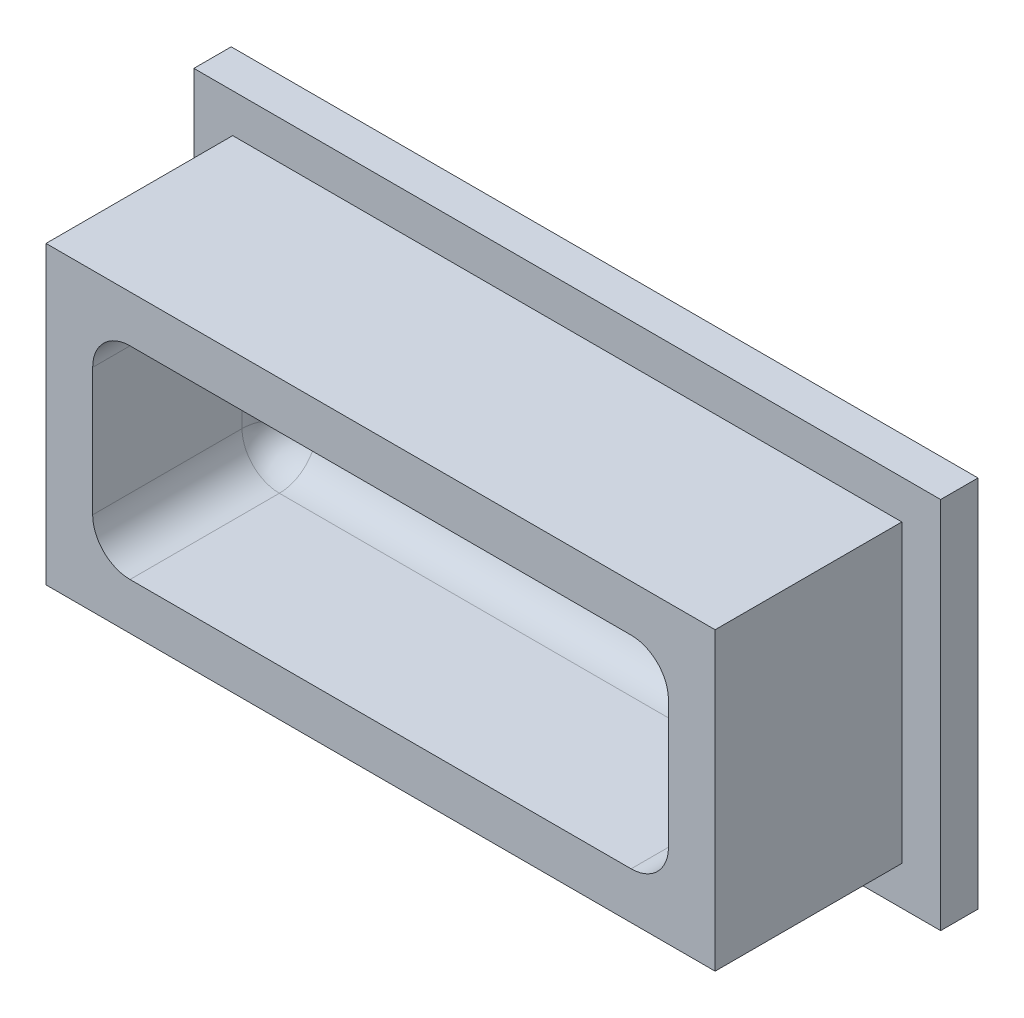
ISO-10303-21;
HEADER;
FILE_DESCRIPTION(('STEP AP214'),'2;1');
FILE_NAME('part.step','',(''),(''),'','','');
FILE_SCHEMA(('AUTOMOTIVE_DESIGN { 1 0 10303 214 1 1 1 1 }'));
ENDSEC;
DATA;
#1=APPLICATION_CONTEXT('core data for automotive mechanical design processes');
#2=APPLICATION_PROTOCOL_DEFINITION('international standard','automotive_design',2000,#1);
#3=PRODUCT_CONTEXT('',#1,'mechanical');
#4=PRODUCT('Part','Part','',(#3));
#5=PRODUCT_RELATED_PRODUCT_CATEGORY('part','',(#4));
#6=PRODUCT_DEFINITION_FORMATION('','',#4);
#7=PRODUCT_DEFINITION_CONTEXT('part definition',#1,'design');
#8=PRODUCT_DEFINITION('design','',#6,#7);
#9=PRODUCT_DEFINITION_SHAPE('','',#8);
#10=(LENGTH_UNIT() NAMED_UNIT(*) SI_UNIT(.MILLI.,.METRE.));
#11=(NAMED_UNIT(*) PLANE_ANGLE_UNIT() SI_UNIT($,.RADIAN.));
#12=(NAMED_UNIT(*) SI_UNIT($,.STERADIAN.) SOLID_ANGLE_UNIT());
#13=UNCERTAINTY_MEASURE_WITH_UNIT(LENGTH_MEASURE(1.E-05),#10,'distance_accuracy_value','');
#14=(GEOMETRIC_REPRESENTATION_CONTEXT(3) GLOBAL_UNCERTAINTY_ASSIGNED_CONTEXT((#13)) GLOBAL_UNIT_ASSIGNED_CONTEXT((#10,
#11,#12)) REPRESENTATION_CONTEXT('',''));
#15=CARTESIAN_POINT('',(0.,0.,0.));
#16=DIRECTION('',(0.,0.,1.));
#17=DIRECTION('',(1.,0.,0.));
#18=AXIS2_PLACEMENT_3D('',#15,#16,#17);
#19=CARTESIAN_POINT('',(0.,0.,2.));
#20=DIRECTION('',(0.,0.,-1.));
#21=DIRECTION('',(-1.,0.,0.));
#22=AXIS2_PLACEMENT_3D('',#19,#20,#21);
#23=PLANE('',#22);
#24=DIRECTION('',(0.,1.,0.));
#25=VECTOR('',#24,1.);
#26=CARTESIAN_POINT('',(20.,-10.,2.));
#27=LINE('',#26,#25);
#28=CARTESIAN_POINT('',(20.,-10.,2.));
#29=VERTEX_POINT('',#28);
#30=CARTESIAN_POINT('',(20.,10.,2.));
#31=VERTEX_POINT('',#30);
#32=EDGE_CURVE('E193',#29,#31,#27,.T.);
#33=ORIENTED_EDGE('',*,*,#32,.T.);
#34=DIRECTION('',(-1.,0.,0.));
#35=VECTOR('',#34,1.);
#36=CARTESIAN_POINT('',(-20.,10.,2.));
#37=LINE('',#36,#35);
#38=CARTESIAN_POINT('',(-20.,10.,2.));
#39=VERTEX_POINT('',#38);
#40=EDGE_CURVE('E196',#31,#39,#37,.T.);
#41=ORIENTED_EDGE('',*,*,#40,.T.);
#42=DIRECTION('',(0.,-1.,0.));
#43=VECTOR('',#42,1.);
#44=CARTESIAN_POINT('',(-20.,-10.,2.));
#45=LINE('',#44,#43);
#46=CARTESIAN_POINT('',(-20.,-10.,2.));
#47=VERTEX_POINT('',#46);
#48=EDGE_CURVE('E199',#39,#47,#45,.T.);
#49=ORIENTED_EDGE('',*,*,#48,.T.);
#50=DIRECTION('',(1.,0.,0.));
#51=VECTOR('',#50,1.);
#52=CARTESIAN_POINT('',(-20.,-10.,2.));
#53=LINE('',#52,#51);
#54=EDGE_CURVE('E201',#47,#29,#53,.T.);
#55=ORIENTED_EDGE('',*,*,#54,.T.);
#56=EDGE_LOOP('',(#33,#41,#49,#55));
#57=FACE_BOUND('',#56,.T.);
#58=DIRECTION('',(0.,-1.,0.));
#59=VECTOR('',#58,1.);
#60=CARTESIAN_POINT('',(-17.92,7.92,2.));
#61=LINE('',#60,#59);
#62=CARTESIAN_POINT('',(-17.92,7.92,2.));
#63=VERTEX_POINT('',#62);
#64=CARTESIAN_POINT('',(-17.92,-7.92,2.));
#65=VERTEX_POINT('',#64);
#66=EDGE_CURVE('E183',#63,#65,#61,.T.);
#67=ORIENTED_EDGE('',*,*,#66,.F.);
#68=DIRECTION('',(-1.,0.,0.));
#69=VECTOR('',#68,1.);
#70=CARTESIAN_POINT('',(17.92,7.92,2.));
#71=LINE('',#70,#69);
#72=CARTESIAN_POINT('',(17.92,7.92,2.));
#73=VERTEX_POINT('',#72);
#74=EDGE_CURVE('E180',#73,#63,#71,.T.);
#75=ORIENTED_EDGE('',*,*,#74,.F.);
#76=DIRECTION('',(0.,1.,0.));
#77=VECTOR('',#76,1.);
#78=CARTESIAN_POINT('',(17.92,-7.92,2.));
#79=LINE('',#78,#77);
#80=CARTESIAN_POINT('',(17.92,-7.92,2.));
#81=VERTEX_POINT('',#80);
#82=EDGE_CURVE('E310',#81,#73,#79,.T.);
#83=ORIENTED_EDGE('',*,*,#82,.F.);
#84=DIRECTION('',(1.,0.,0.));
#85=VECTOR('',#84,1.);
#86=CARTESIAN_POINT('',(-17.92,-7.92,2.));
#87=LINE('',#86,#85);
#88=EDGE_CURVE('E307',#65,#81,#87,.T.);
#89=ORIENTED_EDGE('',*,*,#88,.F.);
#90=EDGE_LOOP('',(#67,#75,#83,#89));
#91=FACE_BOUND('',#90,.T.);
#92=ADVANCED_FACE('F33',(#57,#91),#23,.F.);
#93=CARTESIAN_POINT('',(20.,-10.,2.));
#94=DIRECTION('',(-1.,0.,0.));
#95=DIRECTION('',(0.,0.,1.));
#96=AXIS2_PLACEMENT_3D('',#93,#94,#95);
#97=PLANE('',#96);
#98=DIRECTION('',(0.,1.,0.));
#99=VECTOR('',#98,1.);
#100=CARTESIAN_POINT('',(20.,-10.,0.));
#101=LINE('',#100,#99);
#102=CARTESIAN_POINT('',(20.,-10.,0.));
#103=VERTEX_POINT('',#102);
#104=CARTESIAN_POINT('',(20.,10.,0.));
#105=VERTEX_POINT('',#104);
#106=EDGE_CURVE('E184',#103,#105,#101,.T.);
#107=ORIENTED_EDGE('',*,*,#106,.T.);
#108=DIRECTION('',(0.,0.,-1.));
#109=VECTOR('',#108,1.);
#110=CARTESIAN_POINT('',(20.,10.,2.));
#111=LINE('',#110,#109);
#112=EDGE_CURVE('E216',#31,#105,#111,.T.);
#113=ORIENTED_EDGE('',*,*,#112,.F.);
#114=ORIENTED_EDGE('',*,*,#32,.F.);
#115=DIRECTION('',(0.,0.,-1.));
#116=VECTOR('',#115,1.);
#117=CARTESIAN_POINT('',(20.,-10.,2.));
#118=LINE('',#117,#116);
#119=EDGE_CURVE('E202',#29,#103,#118,.T.);
#120=ORIENTED_EDGE('',*,*,#119,.T.);
#121=EDGE_LOOP('',(#107,#113,#114,#120));
#122=FACE_BOUND('',#121,.T.);
#123=ADVANCED_FACE('F323',(#122),#97,.F.);
#124=CARTESIAN_POINT('',(-20.,10.,2.));
#125=DIRECTION('',(0.,-1.,0.));
#126=DIRECTION('',(0.,0.,-1.));
#127=AXIS2_PLACEMENT_3D('',#124,#125,#126);
#128=PLANE('',#127);
#129=DIRECTION('',(-1.,0.,0.));
#130=VECTOR('',#129,1.);
#131=CARTESIAN_POINT('',(-20.,10.,0.));
#132=LINE('',#131,#130);
#133=CARTESIAN_POINT('',(-20.,10.,0.));
#134=VERTEX_POINT('',#133);
#135=EDGE_CURVE('E187',#105,#134,#132,.T.);
#136=ORIENTED_EDGE('',*,*,#135,.T.);
#137=DIRECTION('',(0.,0.,-1.));
#138=VECTOR('',#137,1.);
#139=CARTESIAN_POINT('',(-20.,10.,2.));
#140=LINE('',#139,#138);
#141=EDGE_CURVE('E213',#39,#134,#140,.T.);
#142=ORIENTED_EDGE('',*,*,#141,.F.);
#143=ORIENTED_EDGE('',*,*,#40,.F.);
#144=ORIENTED_EDGE('',*,*,#112,.T.);
#145=EDGE_LOOP('',(#136,#142,#143,#144));
#146=FACE_BOUND('',#145,.T.);
#147=ADVANCED_FACE('F329',(#146),#128,.F.);
#148=CARTESIAN_POINT('',(-20.,-10.,2.));
#149=DIRECTION('',(1.,0.,0.));
#150=DIRECTION('',(0.,0.,-1.));
#151=AXIS2_PLACEMENT_3D('',#148,#149,#150);
#152=PLANE('',#151);
#153=DIRECTION('',(0.,-1.,0.));
#154=VECTOR('',#153,1.);
#155=CARTESIAN_POINT('',(-20.,-10.,0.));
#156=LINE('',#155,#154);
#157=CARTESIAN_POINT('',(-20.,-10.,0.));
#158=VERTEX_POINT('',#157);
#159=EDGE_CURVE('E205',#134,#158,#156,.T.);
#160=ORIENTED_EDGE('',*,*,#159,.T.);
#161=DIRECTION('',(0.,0.,-1.));
#162=VECTOR('',#161,1.);
#163=CARTESIAN_POINT('',(-20.,-10.,2.));
#164=LINE('',#163,#162);
#165=EDGE_CURVE('E210',#47,#158,#164,.T.);
#166=ORIENTED_EDGE('',*,*,#165,.F.);
#167=ORIENTED_EDGE('',*,*,#48,.F.);
#168=ORIENTED_EDGE('',*,*,#141,.T.);
#169=EDGE_LOOP('',(#160,#166,#167,#168));
#170=FACE_BOUND('',#169,.T.);
#171=ADVANCED_FACE('F342',(#170),#152,.F.);
#172=CARTESIAN_POINT('',(-20.,-10.,2.));
#173=DIRECTION('',(0.,1.,0.));
#174=DIRECTION('',(0.,0.,1.));
#175=AXIS2_PLACEMENT_3D('',#172,#173,#174);
#176=PLANE('',#175);
#177=DIRECTION('',(1.,0.,0.));
#178=VECTOR('',#177,1.);
#179=CARTESIAN_POINT('',(-20.,-10.,0.));
#180=LINE('',#179,#178);
#181=EDGE_CURVE('E197',#158,#103,#180,.T.);
#182=ORIENTED_EDGE('',*,*,#181,.T.);
#183=ORIENTED_EDGE('',*,*,#119,.F.);
#184=ORIENTED_EDGE('',*,*,#54,.F.);
#185=ORIENTED_EDGE('',*,*,#165,.T.);
#186=EDGE_LOOP('',(#182,#183,#184,#185));
#187=FACE_BOUND('',#186,.T.);
#188=ADVANCED_FACE('F338',(#187),#176,.F.);
#189=CARTESIAN_POINT('',(0.,0.,0.));
#190=DIRECTION('',(0.,0.,-1.));
#191=DIRECTION('',(-1.,0.,0.));
#192=AXIS2_PLACEMENT_3D('',#189,#190,#191);
#193=PLANE('',#192);
#194=ORIENTED_EDGE('',*,*,#106,.F.);
#195=ORIENTED_EDGE('',*,*,#181,.F.);
#196=ORIENTED_EDGE('',*,*,#159,.F.);
#197=ORIENTED_EDGE('',*,*,#135,.F.);
#198=EDGE_LOOP('',(#194,#195,#196,#197));
#199=FACE_BOUND('',#198,.T.);
#200=ADVANCED_FACE('F335',(#199),#193,.T.);
#201=CARTESIAN_POINT('',(-17.92,7.92,12.));
#202=DIRECTION('',(1.,0.,0.));
#203=DIRECTION('',(0.,0.,-1.));
#204=AXIS2_PLACEMENT_3D('',#201,#202,#203);
#205=PLANE('',#204);
#206=ORIENTED_EDGE('',*,*,#66,.T.);
#207=DIRECTION('',(0.,0.,-1.));
#208=VECTOR('',#207,1.);
#209=CARTESIAN_POINT('',(-17.92,-7.92,12.));
#210=LINE('',#209,#208);
#211=CARTESIAN_POINT('',(-17.92,-7.92,12.));
#212=VERTEX_POINT('',#211);
#213=EDGE_CURVE('E164',#212,#65,#210,.T.);
#214=ORIENTED_EDGE('',*,*,#213,.F.);
#215=DIRECTION('',(0.,-1.,0.));
#216=VECTOR('',#215,1.);
#217=CARTESIAN_POINT('',(-17.92,7.92,12.));
#218=LINE('',#217,#216);
#219=CARTESIAN_POINT('',(-17.92,7.92,12.));
#220=VERTEX_POINT('',#219);
#221=EDGE_CURVE('E171',#220,#212,#218,.T.);
#222=ORIENTED_EDGE('',*,*,#221,.F.);
#223=DIRECTION('',(0.,0.,-1.));
#224=VECTOR('',#223,1.);
#225=CARTESIAN_POINT('',(-17.92,7.92,12.));
#226=LINE('',#225,#224);
#227=EDGE_CURVE('E305',#220,#63,#226,.T.);
#228=ORIENTED_EDGE('',*,*,#227,.T.);
#229=EDGE_LOOP('',(#206,#214,#222,#228));
#230=FACE_BOUND('',#229,.T.);
#231=ADVANCED_FACE('F182',(#230),#205,.F.);
#232=CARTESIAN_POINT('',(-17.92,-7.92,12.));
#233=DIRECTION('',(0.,1.,0.));
#234=DIRECTION('',(0.,0.,1.));
#235=AXIS2_PLACEMENT_3D('',#232,#233,#234);
#236=PLANE('',#235);
#237=ORIENTED_EDGE('',*,*,#88,.T.);
#238=DIRECTION('',(0.,0.,-1.));
#239=VECTOR('',#238,1.);
#240=CARTESIAN_POINT('',(17.92,-7.92,12.));
#241=LINE('',#240,#239);
#242=CARTESIAN_POINT('',(17.92,-7.92,12.));
#243=VERTEX_POINT('',#242);
#244=EDGE_CURVE('E167',#243,#81,#241,.T.);
#245=ORIENTED_EDGE('',*,*,#244,.F.);
#246=DIRECTION('',(1.,0.,0.));
#247=VECTOR('',#246,1.);
#248=CARTESIAN_POINT('',(-17.92,-7.92,12.));
#249=LINE('',#248,#247);
#250=EDGE_CURVE('E159',#212,#243,#249,.T.);
#251=ORIENTED_EDGE('',*,*,#250,.F.);
#252=ORIENTED_EDGE('',*,*,#213,.T.);
#253=EDGE_LOOP('',(#237,#245,#251,#252));
#254=FACE_BOUND('',#253,.T.);
#255=ADVANCED_FACE('F162',(#254),#236,.F.);
#256=CARTESIAN_POINT('',(17.92,-7.92,12.));
#257=DIRECTION('',(-1.,0.,0.));
#258=DIRECTION('',(0.,0.,1.));
#259=AXIS2_PLACEMENT_3D('',#256,#257,#258);
#260=PLANE('',#259);
#261=ORIENTED_EDGE('',*,*,#82,.T.);
#262=DIRECTION('',(0.,0.,-1.));
#263=VECTOR('',#262,1.);
#264=CARTESIAN_POINT('',(17.92,7.92,12.));
#265=LINE('',#264,#263);
#266=CARTESIAN_POINT('',(17.92,7.92,12.));
#267=VERTEX_POINT('',#266);
#268=EDGE_CURVE('E189',#267,#73,#265,.T.);
#269=ORIENTED_EDGE('',*,*,#268,.F.);
#270=DIRECTION('',(0.,1.,0.));
#271=VECTOR('',#270,1.);
#272=CARTESIAN_POINT('',(17.92,-7.92,12.));
#273=LINE('',#272,#271);
#274=EDGE_CURVE('E170',#243,#267,#273,.T.);
#275=ORIENTED_EDGE('',*,*,#274,.F.);
#276=ORIENTED_EDGE('',*,*,#244,.T.);
#277=EDGE_LOOP('',(#261,#269,#275,#276));
#278=FACE_BOUND('',#277,.T.);
#279=ADVANCED_FACE('F320',(#278),#260,.F.);
#280=CARTESIAN_POINT('',(17.92,7.92,12.));
#281=DIRECTION('',(0.,-1.,0.));
#282=DIRECTION('',(0.,0.,-1.));
#283=AXIS2_PLACEMENT_3D('',#280,#281,#282);
#284=PLANE('',#283);
#285=ORIENTED_EDGE('',*,*,#74,.T.);
#286=ORIENTED_EDGE('',*,*,#227,.F.);
#287=DIRECTION('',(-1.,0.,0.));
#288=VECTOR('',#287,1.);
#289=CARTESIAN_POINT('',(17.92,7.92,12.));
#290=LINE('',#289,#288);
#291=EDGE_CURVE('E176',#267,#220,#290,.T.);
#292=ORIENTED_EDGE('',*,*,#291,.F.);
#293=ORIENTED_EDGE('',*,*,#268,.T.);
#294=EDGE_LOOP('',(#285,#286,#292,#293));
#295=FACE_BOUND('',#294,.T.);
#296=ADVANCED_FACE('F318',(#295),#284,.F.);
#297=CARTESIAN_POINT('',(0.,0.,12.));
#298=DIRECTION('',(0.,0.,1.));
#299=DIRECTION('',(1.,0.,0.));
#300=AXIS2_PLACEMENT_3D('',#297,#298,#299);
#301=PLANE('',#300);
#302=DIRECTION('',(0.,-1.,0.));
#303=VECTOR('',#302,1.);
#304=CARTESIAN_POINT('',(-15.42,5.42,12.));
#305=LINE('',#304,#303);
#306=CARTESIAN_POINT('',(-15.42,3.42,12.));
#307=VERTEX_POINT('',#306);
#308=CARTESIAN_POINT('',(-15.42,-3.42,12.));
#309=VERTEX_POINT('',#308);
#310=EDGE_CURVE('E293',#307,#309,#305,.T.);
#311=ORIENTED_EDGE('',*,*,#310,.F.);
#312=CARTESIAN_POINT('',(-13.42,3.42,12.));
#313=DIRECTION('',(0.,0.,1.));
#314=DIRECTION('',(1.,0.,0.));
#315=AXIS2_PLACEMENT_3D('',#312,#313,#314);
#316=CIRCLE('',#315,2.);
#317=CARTESIAN_POINT('',(-13.42,5.42,12.));
#318=VERTEX_POINT('',#317);
#319=EDGE_CURVE('E11',#307,#318,#316,.F.);
#320=ORIENTED_EDGE('',*,*,#319,.T.);
#321=DIRECTION('',(-1.,0.,0.));
#322=VECTOR('',#321,1.);
#323=CARTESIAN_POINT('',(15.42,5.42,12.));
#324=LINE('',#323,#322);
#325=CARTESIAN_POINT('',(13.42,5.42,12.));
#326=VERTEX_POINT('',#325);
#327=EDGE_CURVE('E288',#326,#318,#324,.T.);
#328=ORIENTED_EDGE('',*,*,#327,.F.);
#329=CARTESIAN_POINT('',(13.42,3.42,12.));
#330=DIRECTION('',(0.,0.,1.));
#331=DIRECTION('',(1.,0.,0.));
#332=AXIS2_PLACEMENT_3D('',#329,#330,#331);
#333=CIRCLE('',#332,2.);
#334=CARTESIAN_POINT('',(15.42,3.42,12.));
#335=VERTEX_POINT('',#334);
#336=EDGE_CURVE('E250',#326,#335,#333,.F.);
#337=ORIENTED_EDGE('',*,*,#336,.T.);
#338=DIRECTION('',(0.,1.,0.));
#339=VECTOR('',#338,1.);
#340=CARTESIAN_POINT('',(15.42,-5.42,12.));
#341=LINE('',#340,#339);
#342=CARTESIAN_POINT('',(15.42,-3.42,12.));
#343=VERTEX_POINT('',#342);
#344=EDGE_CURVE('E308',#343,#335,#341,.T.);
#345=ORIENTED_EDGE('',*,*,#344,.F.);
#346=CARTESIAN_POINT('',(13.42,-3.42,12.));
#347=DIRECTION('',(0.,0.,1.));
#348=DIRECTION('',(1.,0.,0.));
#349=AXIS2_PLACEMENT_3D('',#346,#347,#348);
#350=CIRCLE('',#349,2.);
#351=CARTESIAN_POINT('',(13.42,-5.42,12.));
#352=VERTEX_POINT('',#351);
#353=EDGE_CURVE('E252',#343,#352,#350,.F.);
#354=ORIENTED_EDGE('',*,*,#353,.T.);
#355=DIRECTION('',(1.,0.,0.));
#356=VECTOR('',#355,1.);
#357=CARTESIAN_POINT('',(-15.42,-5.42,12.));
#358=LINE('',#357,#356);
#359=CARTESIAN_POINT('',(-13.42,-5.42,12.));
#360=VERTEX_POINT('',#359);
#361=EDGE_CURVE('E299',#360,#352,#358,.T.);
#362=ORIENTED_EDGE('',*,*,#361,.F.);
#363=CARTESIAN_POINT('',(-13.42,-3.42,12.));
#364=DIRECTION('',(0.,0.,1.));
#365=DIRECTION('',(1.,0.,0.));
#366=AXIS2_PLACEMENT_3D('',#363,#364,#365);
#367=CIRCLE('',#366,2.);
#368=EDGE_CURVE('E42',#360,#309,#367,.F.);
#369=ORIENTED_EDGE('',*,*,#368,.T.);
#370=EDGE_LOOP('',(#311,#320,#328,#337,#345,#354,#362,#369));
#371=FACE_BOUND('',#370,.T.);
#372=ORIENTED_EDGE('',*,*,#221,.T.);
#373=ORIENTED_EDGE('',*,*,#250,.T.);
#374=ORIENTED_EDGE('',*,*,#274,.T.);
#375=ORIENTED_EDGE('',*,*,#291,.T.);
#376=EDGE_LOOP('',(#372,#373,#374,#375));
#377=FACE_BOUND('',#376,.T.);
#378=ADVANCED_FACE('F174',(#371,#377),#301,.T.);
#379=CARTESIAN_POINT('',(0.,0.,2.));
#380=DIRECTION('',(0.,0.,-1.));
#381=DIRECTION('',(-1.,0.,0.));
#382=AXIS2_PLACEMENT_3D('',#379,#380,#381);
#383=PLANE('',#382);
#384=DIRECTION('',(1.,0.,0.));
#385=VECTOR('',#384,1.);
#386=CARTESIAN_POINT('',(15.42,-3.42,2.));
#387=LINE('',#386,#385);
#388=CARTESIAN_POINT('',(-13.42,-3.42,2.));
#389=VERTEX_POINT('',#388);
#390=CARTESIAN_POINT('',(13.42,-3.42,2.));
#391=VERTEX_POINT('',#390);
#392=EDGE_CURVE('E50',#389,#391,#387,.T.);
#393=ORIENTED_EDGE('',*,*,#392,.T.);
#394=DIRECTION('',(0.,1.,0.));
#395=VECTOR('',#394,1.);
#396=CARTESIAN_POINT('',(13.42,5.42,2.));
#397=LINE('',#396,#395);
#398=CARTESIAN_POINT('',(13.42,3.42,2.));
#399=VERTEX_POINT('',#398);
#400=EDGE_CURVE('E248',#391,#399,#397,.T.);
#401=ORIENTED_EDGE('',*,*,#400,.T.);
#402=DIRECTION('',(-1.,0.,0.));
#403=VECTOR('',#402,1.);
#404=CARTESIAN_POINT('',(-15.42,3.42,2.));
#405=LINE('',#404,#403);
#406=CARTESIAN_POINT('',(-13.42,3.42,2.));
#407=VERTEX_POINT('',#406);
#408=EDGE_CURVE('E244',#399,#407,#405,.T.);
#409=ORIENTED_EDGE('',*,*,#408,.T.);
#410=DIRECTION('',(0.,-1.,0.));
#411=VECTOR('',#410,1.);
#412=CARTESIAN_POINT('',(-13.42,-5.42,2.));
#413=LINE('',#412,#411);
#414=EDGE_CURVE('E55',#407,#389,#413,.T.);
#415=ORIENTED_EDGE('',*,*,#414,.T.);
#416=EDGE_LOOP('',(#393,#401,#409,#415));
#417=FACE_BOUND('',#416,.T.);
#418=ADVANCED_FACE('F429',(#417),#383,.F.);
#419=CARTESIAN_POINT('',(-15.42,5.42,-30.6896191473685));
#420=DIRECTION('',(-1.,0.,0.));
#421=DIRECTION('',(0.,0.,1.));
#422=AXIS2_PLACEMENT_3D('',#419,#420,#421);
#423=PLANE('',#422);
#424=ORIENTED_EDGE('',*,*,#310,.T.);
#425=DIRECTION('',(0.,0.,1.));
#426=VECTOR('',#425,1.);
#427=CARTESIAN_POINT('',(-15.42,-3.42,2.));
#428=LINE('',#427,#426);
#429=CARTESIAN_POINT('',(-15.42,-3.42,4.));
#430=VERTEX_POINT('',#429);
#431=EDGE_CURVE('E242',#309,#430,#428,.F.);
#432=ORIENTED_EDGE('',*,*,#431,.T.);
#433=DIRECTION('',(0.,-1.,0.));
#434=VECTOR('',#433,1.);
#435=CARTESIAN_POINT('',(-15.42,5.42,4.));
#436=LINE('',#435,#434);
#437=CARTESIAN_POINT('',(-15.42,3.42,4.));
#438=VERTEX_POINT('',#437);
#439=EDGE_CURVE('E238',#430,#438,#436,.F.);
#440=ORIENTED_EDGE('',*,*,#439,.T.);
#441=DIRECTION('',(0.,0.,1.));
#442=VECTOR('',#441,1.);
#443=CARTESIAN_POINT('',(-15.42,3.42,12.));
#444=LINE('',#443,#442);
#445=EDGE_CURVE('E240',#438,#307,#444,.T.);
#446=ORIENTED_EDGE('',*,*,#445,.T.);
#447=EDGE_LOOP('',(#424,#432,#440,#446));
#448=FACE_BOUND('',#447,.T.);
#449=ADVANCED_FACE('F399',(#448),#423,.F.);
#450=CARTESIAN_POINT('',(-15.42,-5.42,-30.6896191473685));
#451=DIRECTION('',(0.,-1.,0.));
#452=DIRECTION('',(0.,0.,-1.));
#453=AXIS2_PLACEMENT_3D('',#450,#451,#452);
#454=PLANE('',#453);
#455=ORIENTED_EDGE('',*,*,#361,.T.);
#456=DIRECTION('',(0.,0.,1.));
#457=VECTOR('',#456,1.);
#458=CARTESIAN_POINT('',(13.42,-5.42,2.));
#459=LINE('',#458,#457);
#460=CARTESIAN_POINT('',(13.42,-5.42,4.));
#461=VERTEX_POINT('',#460);
#462=EDGE_CURVE('E236',#352,#461,#459,.F.);
#463=ORIENTED_EDGE('',*,*,#462,.T.);
#464=DIRECTION('',(1.,0.,0.));
#465=VECTOR('',#464,1.);
#466=CARTESIAN_POINT('',(-15.42,-5.42,4.));
#467=LINE('',#466,#465);
#468=CARTESIAN_POINT('',(-13.42,-5.42,4.));
#469=VERTEX_POINT('',#468);
#470=EDGE_CURVE('E232',#461,#469,#467,.F.);
#471=ORIENTED_EDGE('',*,*,#470,.T.);
#472=DIRECTION('',(0.,0.,1.));
#473=VECTOR('',#472,1.);
#474=CARTESIAN_POINT('',(-13.42,-5.42,12.));
#475=LINE('',#474,#473);
#476=EDGE_CURVE('E234',#469,#360,#475,.T.);
#477=ORIENTED_EDGE('',*,*,#476,.T.);
#478=EDGE_LOOP('',(#455,#463,#471,#477));
#479=FACE_BOUND('',#478,.T.);
#480=ADVANCED_FACE('F411',(#479),#454,.F.);
#481=CARTESIAN_POINT('',(15.42,-5.42,-30.6896191473685));
#482=DIRECTION('',(1.,0.,0.));
#483=DIRECTION('',(0.,0.,-1.));
#484=AXIS2_PLACEMENT_3D('',#481,#482,#483);
#485=PLANE('',#484);
#486=ORIENTED_EDGE('',*,*,#344,.T.);
#487=DIRECTION('',(0.,0.,1.));
#488=VECTOR('',#487,1.);
#489=CARTESIAN_POINT('',(15.42,3.42,2.));
#490=LINE('',#489,#488);
#491=CARTESIAN_POINT('',(15.42,3.42,4.));
#492=VERTEX_POINT('',#491);
#493=EDGE_CURVE('E230',#335,#492,#490,.F.);
#494=ORIENTED_EDGE('',*,*,#493,.T.);
#495=DIRECTION('',(0.,1.,0.));
#496=VECTOR('',#495,1.);
#497=CARTESIAN_POINT('',(15.42,-5.42,4.));
#498=LINE('',#497,#496);
#499=CARTESIAN_POINT('',(15.42,-3.42,4.));
#500=VERTEX_POINT('',#499);
#501=EDGE_CURVE('E226',#492,#500,#498,.F.);
#502=ORIENTED_EDGE('',*,*,#501,.T.);
#503=DIRECTION('',(0.,0.,1.));
#504=VECTOR('',#503,1.);
#505=CARTESIAN_POINT('',(15.42,-3.42,12.));
#506=LINE('',#505,#504);
#507=EDGE_CURVE('E228',#500,#343,#506,.T.);
#508=ORIENTED_EDGE('',*,*,#507,.T.);
#509=EDGE_LOOP('',(#486,#494,#502,#508));
#510=FACE_BOUND('',#509,.T.);
#511=ADVANCED_FACE('F419',(#510),#485,.F.);
#512=CARTESIAN_POINT('',(15.42,5.42,-30.6896191473685));
#513=DIRECTION('',(0.,1.,0.));
#514=DIRECTION('',(0.,0.,1.));
#515=AXIS2_PLACEMENT_3D('',#512,#513,#514);
#516=PLANE('',#515);
#517=DIRECTION('',(-1.,0.,0.));
#518=VECTOR('',#517,1.);
#519=CARTESIAN_POINT('',(15.42,5.42,4.));
#520=LINE('',#519,#518);
#521=CARTESIAN_POINT('',(-13.42,5.42,4.));
#522=VERTEX_POINT('',#521);
#523=CARTESIAN_POINT('',(13.42,5.42,4.));
#524=VERTEX_POINT('',#523);
#525=EDGE_CURVE('E219',#522,#524,#520,.F.);
#526=ORIENTED_EDGE('',*,*,#525,.T.);
#527=DIRECTION('',(0.,0.,1.));
#528=VECTOR('',#527,1.);
#529=CARTESIAN_POINT('',(13.42,5.42,12.));
#530=LINE('',#529,#528);
#531=EDGE_CURVE('E223',#524,#326,#530,.T.);
#532=ORIENTED_EDGE('',*,*,#531,.T.);
#533=ORIENTED_EDGE('',*,*,#327,.T.);
#534=DIRECTION('',(0.,0.,1.));
#535=VECTOR('',#534,1.);
#536=CARTESIAN_POINT('',(-13.42,5.42,2.));
#537=LINE('',#536,#535);
#538=EDGE_CURVE('E221',#318,#522,#537,.F.);
#539=ORIENTED_EDGE('',*,*,#538,.T.);
#540=EDGE_LOOP('',(#526,#532,#533,#539));
#541=FACE_BOUND('',#540,.T.);
#542=ADVANCED_FACE('F393',(#541),#516,.F.);
#543=CARTESIAN_POINT('',(-13.42,-3.42,-30.6896191473685));
#544=DIRECTION('',(0.,0.,-1.));
#545=DIRECTION('',(-1.,0.,0.));
#546=AXIS2_PLACEMENT_3D('',#543,#544,#545);
#547=CYLINDRICAL_SURFACE('',#546,2.);
#548=CARTESIAN_POINT('',(-13.42,-3.42,4.));
#549=DIRECTION('',(0.,0.,1.));
#550=DIRECTION('',(1.,0.,0.));
#551=AXIS2_PLACEMENT_3D('',#548,#549,#550);
#552=CIRCLE('',#551,2.);
#553=EDGE_CURVE('E37',#430,#469,#552,.T.);
#554=ORIENTED_EDGE('',*,*,#553,.F.);
#555=ORIENTED_EDGE('',*,*,#431,.F.);
#556=ORIENTED_EDGE('',*,*,#368,.F.);
#557=ORIENTED_EDGE('',*,*,#476,.F.);
#558=EDGE_LOOP('',(#554,#555,#556,#557));
#559=FACE_BOUND('',#558,.T.);
#560=ADVANCED_FACE('F35',(#559),#547,.F.);
#561=CARTESIAN_POINT('',(-13.42,-3.42,4.));
#562=DIRECTION('',(0.,0.,1.));
#563=DIRECTION('',(1.,0.,0.));
#564=AXIS2_PLACEMENT_3D('',#561,#562,#563);
#565=SPHERICAL_SURFACE('',#564,2.);
#566=CARTESIAN_POINT('',(-13.42,-3.42,4.));
#567=DIRECTION('',(0.,1.,0.));
#568=DIRECTION('',(0.,0.,1.));
#569=AXIS2_PLACEMENT_3D('',#566,#567,#568);
#570=CIRCLE('',#569,2.);
#571=EDGE_CURVE('E281',#430,#389,#570,.F.);
#572=ORIENTED_EDGE('',*,*,#571,.F.);
#573=ORIENTED_EDGE('',*,*,#553,.T.);
#574=CARTESIAN_POINT('',(-13.42,-3.42,4.));
#575=DIRECTION('',(1.,0.,0.));
#576=DIRECTION('',(0.,0.,-1.));
#577=AXIS2_PLACEMENT_3D('',#574,#575,#576);
#578=CIRCLE('',#577,2.);
#579=EDGE_CURVE('E282',#389,#469,#578,.F.);
#580=ORIENTED_EDGE('',*,*,#579,.F.);
#581=EDGE_LOOP('',(#572,#573,#580));
#582=FACE_BOUND('',#581,.T.);
#583=ADVANCED_FACE('F387',(#582),#565,.F.);
#584=CARTESIAN_POINT('',(13.42,-3.42,-30.6896191473685));
#585=DIRECTION('',(0.,0.,-1.));
#586=DIRECTION('',(-1.,0.,0.));
#587=AXIS2_PLACEMENT_3D('',#584,#585,#586);
#588=CYLINDRICAL_SURFACE('',#587,2.);
#589=ORIENTED_EDGE('',*,*,#353,.F.);
#590=ORIENTED_EDGE('',*,*,#507,.F.);
#591=CARTESIAN_POINT('',(13.42,-3.42,4.));
#592=DIRECTION('',(0.,0.,1.));
#593=DIRECTION('',(1.,0.,0.));
#594=AXIS2_PLACEMENT_3D('',#591,#592,#593);
#595=CIRCLE('',#594,2.);
#596=EDGE_CURVE('E278',#461,#500,#595,.T.);
#597=ORIENTED_EDGE('',*,*,#596,.F.);
#598=ORIENTED_EDGE('',*,*,#462,.F.);
#599=EDGE_LOOP('',(#589,#590,#597,#598));
#600=FACE_BOUND('',#599,.T.);
#601=ADVANCED_FACE('F385',(#600),#588,.F.);
#602=CARTESIAN_POINT('',(0.,-3.42,4.));
#603=DIRECTION('',(-1.,0.,0.));
#604=DIRECTION('',(0.,0.,1.));
#605=AXIS2_PLACEMENT_3D('',#602,#603,#604);
#606=CYLINDRICAL_SURFACE('',#605,2.);
#607=ORIENTED_EDGE('',*,*,#579,.T.);
#608=ORIENTED_EDGE('',*,*,#470,.F.);
#609=CARTESIAN_POINT('',(13.42,-3.42,4.));
#610=DIRECTION('',(-1.,0.,0.));
#611=DIRECTION('',(0.,0.,1.));
#612=AXIS2_PLACEMENT_3D('',#609,#610,#611);
#613=CIRCLE('',#612,2.);
#614=EDGE_CURVE('E275',#391,#461,#613,.T.);
#615=ORIENTED_EDGE('',*,*,#614,.F.);
#616=ORIENTED_EDGE('',*,*,#392,.F.);
#617=EDGE_LOOP('',(#607,#608,#615,#616));
#618=FACE_BOUND('',#617,.T.);
#619=ADVANCED_FACE('F381',(#618),#606,.F.);
#620=CARTESIAN_POINT('',(-13.42,0.,4.));
#621=DIRECTION('',(0.,1.,0.));
#622=DIRECTION('',(0.,0.,1.));
#623=AXIS2_PLACEMENT_3D('',#620,#621,#622);
#624=CYLINDRICAL_SURFACE('',#623,2.);
#625=ORIENTED_EDGE('',*,*,#571,.T.);
#626=ORIENTED_EDGE('',*,*,#414,.F.);
#627=CARTESIAN_POINT('',(-13.42,3.42,4.));
#628=DIRECTION('',(0.,-1.,0.));
#629=DIRECTION('',(0.,0.,-1.));
#630=AXIS2_PLACEMENT_3D('',#627,#628,#629);
#631=CIRCLE('',#630,2.);
#632=EDGE_CURVE('E272',#438,#407,#631,.T.);
#633=ORIENTED_EDGE('',*,*,#632,.F.);
#634=ORIENTED_EDGE('',*,*,#439,.F.);
#635=EDGE_LOOP('',(#625,#626,#633,#634));
#636=FACE_BOUND('',#635,.T.);
#637=ADVANCED_FACE('F377',(#636),#624,.F.);
#638=CARTESIAN_POINT('',(-13.42,3.42,-30.6896191473685));
#639=DIRECTION('',(0.,0.,-1.));
#640=DIRECTION('',(-1.,0.,0.));
#641=AXIS2_PLACEMENT_3D('',#638,#639,#640);
#642=CYLINDRICAL_SURFACE('',#641,2.);
#643=ORIENTED_EDGE('',*,*,#319,.F.);
#644=ORIENTED_EDGE('',*,*,#445,.F.);
#645=CARTESIAN_POINT('',(-13.42,3.42,4.));
#646=DIRECTION('',(0.,0.,1.));
#647=DIRECTION('',(1.,0.,0.));
#648=AXIS2_PLACEMENT_3D('',#645,#646,#647);
#649=CIRCLE('',#648,2.);
#650=EDGE_CURVE('E269',#522,#438,#649,.T.);
#651=ORIENTED_EDGE('',*,*,#650,.F.);
#652=ORIENTED_EDGE('',*,*,#538,.F.);
#653=EDGE_LOOP('',(#643,#644,#651,#652));
#654=FACE_BOUND('',#653,.T.);
#655=ADVANCED_FACE('F373',(#654),#642,.F.);
#656=CARTESIAN_POINT('',(13.42,-3.42,4.));
#657=DIRECTION('',(0.,0.,1.));
#658=DIRECTION('',(1.,0.,0.));
#659=AXIS2_PLACEMENT_3D('',#656,#657,#658);
#660=SPHERICAL_SURFACE('',#659,2.);
#661=ORIENTED_EDGE('',*,*,#614,.T.);
#662=ORIENTED_EDGE('',*,*,#596,.T.);
#663=CARTESIAN_POINT('',(13.42,-3.42,4.));
#664=DIRECTION('',(0.,1.,0.));
#665=DIRECTION('',(0.,0.,1.));
#666=AXIS2_PLACEMENT_3D('',#663,#664,#665);
#667=CIRCLE('',#666,2.);
#668=EDGE_CURVE('E266',#391,#500,#667,.F.);
#669=ORIENTED_EDGE('',*,*,#668,.F.);
#670=EDGE_LOOP('',(#661,#662,#669));
#671=FACE_BOUND('',#670,.T.);
#672=ADVANCED_FACE('F369',(#671),#660,.F.);
#673=CARTESIAN_POINT('',(-13.42,3.42,4.));
#674=DIRECTION('',(0.,0.,1.));
#675=DIRECTION('',(1.,0.,0.));
#676=AXIS2_PLACEMENT_3D('',#673,#674,#675);
#677=SPHERICAL_SURFACE('',#676,2.);
#678=ORIENTED_EDGE('',*,*,#650,.T.);
#679=ORIENTED_EDGE('',*,*,#632,.T.);
#680=CARTESIAN_POINT('',(-13.42,3.42,4.));
#681=DIRECTION('',(1.,0.,0.));
#682=DIRECTION('',(0.,0.,-1.));
#683=AXIS2_PLACEMENT_3D('',#680,#681,#682);
#684=CIRCLE('',#683,2.);
#685=EDGE_CURVE('E263',#522,#407,#684,.F.);
#686=ORIENTED_EDGE('',*,*,#685,.F.);
#687=EDGE_LOOP('',(#678,#679,#686));
#688=FACE_BOUND('',#687,.T.);
#689=ADVANCED_FACE('F365',(#688),#677,.F.);
#690=CARTESIAN_POINT('',(13.42,0.,4.));
#691=DIRECTION('',(0.,-1.,0.));
#692=DIRECTION('',(0.,0.,-1.));
#693=AXIS2_PLACEMENT_3D('',#690,#691,#692);
#694=CYLINDRICAL_SURFACE('',#693,2.);
#695=ORIENTED_EDGE('',*,*,#668,.T.);
#696=ORIENTED_EDGE('',*,*,#501,.F.);
#697=CARTESIAN_POINT('',(13.42,3.42,4.));
#698=DIRECTION('',(0.,-1.,0.));
#699=DIRECTION('',(0.,0.,-1.));
#700=AXIS2_PLACEMENT_3D('',#697,#698,#699);
#701=CIRCLE('',#700,2.);
#702=EDGE_CURVE('E260',#399,#492,#701,.T.);
#703=ORIENTED_EDGE('',*,*,#702,.F.);
#704=ORIENTED_EDGE('',*,*,#400,.F.);
#705=EDGE_LOOP('',(#695,#696,#703,#704));
#706=FACE_BOUND('',#705,.T.);
#707=ADVANCED_FACE('F361',(#706),#694,.F.);
#708=CARTESIAN_POINT('',(0.,3.42,4.));
#709=DIRECTION('',(1.,0.,0.));
#710=DIRECTION('',(0.,0.,-1.));
#711=AXIS2_PLACEMENT_3D('',#708,#709,#710);
#712=CYLINDRICAL_SURFACE('',#711,2.);
#713=ORIENTED_EDGE('',*,*,#685,.T.);
#714=ORIENTED_EDGE('',*,*,#408,.F.);
#715=CARTESIAN_POINT('',(13.42,3.42,4.));
#716=DIRECTION('',(-1.,0.,0.));
#717=DIRECTION('',(0.,0.,1.));
#718=AXIS2_PLACEMENT_3D('',#715,#716,#717);
#719=CIRCLE('',#718,2.);
#720=EDGE_CURVE('E258',#524,#399,#719,.T.);
#721=ORIENTED_EDGE('',*,*,#720,.F.);
#722=ORIENTED_EDGE('',*,*,#525,.F.);
#723=EDGE_LOOP('',(#713,#714,#721,#722));
#724=FACE_BOUND('',#723,.T.);
#725=ADVANCED_FACE('F357',(#724),#712,.F.);
#726=CARTESIAN_POINT('',(13.42,3.42,4.));
#727=DIRECTION('',(0.,0.,1.));
#728=DIRECTION('',(1.,0.,0.));
#729=AXIS2_PLACEMENT_3D('',#726,#727,#728);
#730=SPHERICAL_SURFACE('',#729,2.);
#731=ORIENTED_EDGE('',*,*,#720,.T.);
#732=ORIENTED_EDGE('',*,*,#702,.T.);
#733=CARTESIAN_POINT('',(13.42,3.42,4.));
#734=DIRECTION('',(0.,0.,1.));
#735=DIRECTION('',(1.,0.,0.));
#736=AXIS2_PLACEMENT_3D('',#733,#734,#735);
#737=CIRCLE('',#736,2.);
#738=EDGE_CURVE('E255',#524,#492,#737,.F.);
#739=ORIENTED_EDGE('',*,*,#738,.F.);
#740=EDGE_LOOP('',(#731,#732,#739));
#741=FACE_BOUND('',#740,.T.);
#742=ADVANCED_FACE('F353',(#741),#730,.F.);
#743=CARTESIAN_POINT('',(13.42,3.42,-30.6896191473685));
#744=DIRECTION('',(0.,0.,-1.));
#745=DIRECTION('',(-1.,0.,0.));
#746=AXIS2_PLACEMENT_3D('',#743,#744,#745);
#747=CYLINDRICAL_SURFACE('',#746,2.);
#748=ORIENTED_EDGE('',*,*,#738,.T.);
#749=ORIENTED_EDGE('',*,*,#493,.F.);
#750=ORIENTED_EDGE('',*,*,#336,.F.);
#751=ORIENTED_EDGE('',*,*,#531,.F.);
#752=EDGE_LOOP('',(#748,#749,#750,#751));
#753=FACE_BOUND('',#752,.T.);
#754=ADVANCED_FACE('F350',(#753),#747,.F.);
#755=CLOSED_SHELL('',(#92,#123,#147,#171,#188,#200,#231,#255,#279,#296,#378,#418,#449,#480,#511,
#542,#560,#583,#601,#619,#637,#655,#672,#689,#707,#725,#742,#754));
#756=MANIFOLD_SOLID_BREP('B2',#755);
#757=ADVANCED_BREP_SHAPE_REPRESENTATION('',(#18,#756),#14);
#758=SHAPE_DEFINITION_REPRESENTATION(#9,#757);
ENDSEC;
END-ISO-10303-21;
